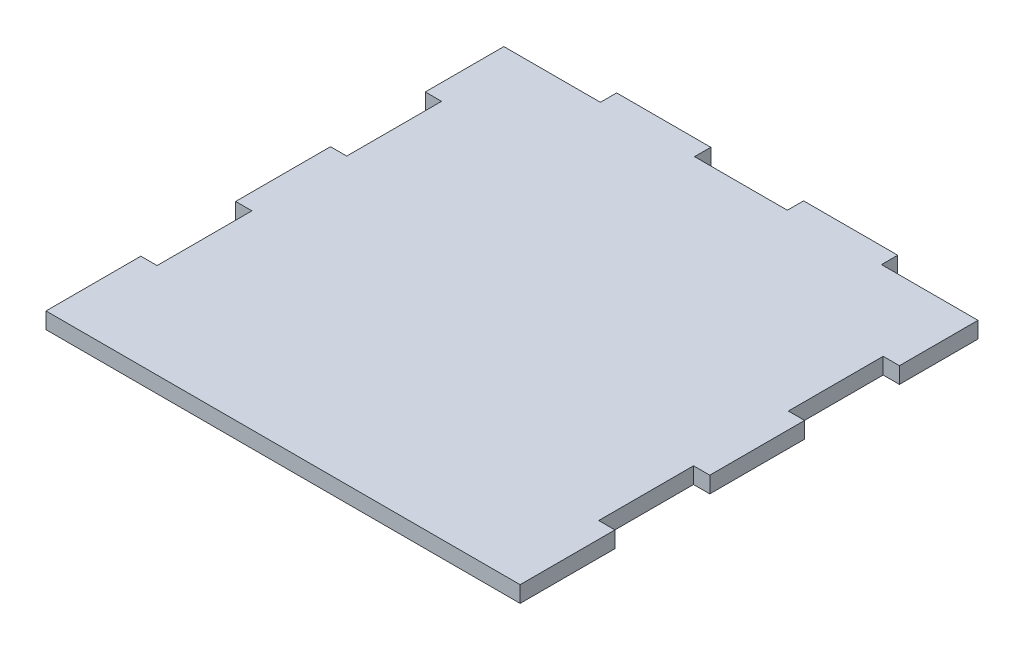
ISO-10303-21;
HEADER;
FILE_DESCRIPTION(('STEP AP214'),'2;1');
FILE_NAME('part.step','',(''),(''),'','','');
FILE_SCHEMA(('AUTOMOTIVE_DESIGN { 1 0 10303 214 1 1 1 1 }'));
ENDSEC;
DATA;
#1=APPLICATION_CONTEXT('core data for automotive mechanical design processes');
#2=APPLICATION_PROTOCOL_DEFINITION('international standard','automotive_design',2000,#1);
#3=PRODUCT_CONTEXT('',#1,'mechanical');
#4=PRODUCT('Part','Part','',(#3));
#5=PRODUCT_RELATED_PRODUCT_CATEGORY('part','',(#4));
#6=PRODUCT_DEFINITION_FORMATION('','',#4);
#7=PRODUCT_DEFINITION_CONTEXT('part definition',#1,'design');
#8=PRODUCT_DEFINITION('design','',#6,#7);
#9=PRODUCT_DEFINITION_SHAPE('','',#8);
#10=(LENGTH_UNIT() NAMED_UNIT(*) SI_UNIT(.MILLI.,.METRE.));
#11=(NAMED_UNIT(*) PLANE_ANGLE_UNIT() SI_UNIT($,.RADIAN.));
#12=(NAMED_UNIT(*) SI_UNIT($,.STERADIAN.) SOLID_ANGLE_UNIT());
#13=UNCERTAINTY_MEASURE_WITH_UNIT(LENGTH_MEASURE(1.E-05),#10,'distance_accuracy_value','');
#14=(GEOMETRIC_REPRESENTATION_CONTEXT(3) GLOBAL_UNCERTAINTY_ASSIGNED_CONTEXT((#13)) GLOBAL_UNIT_ASSIGNED_CONTEXT((#10,
#11,#12)) REPRESENTATION_CONTEXT('',''));
#15=CARTESIAN_POINT('',(0.,0.,0.));
#16=DIRECTION('',(0.,0.,1.));
#17=DIRECTION('',(1.,0.,0.));
#18=AXIS2_PLACEMENT_3D('',#15,#16,#17);
#19=CARTESIAN_POINT('',(0.,12.,-280.));
#20=DIRECTION('',(0.,0.,1.));
#21=DIRECTION('',(1.,0.,0.));
#22=AXIS2_PLACEMENT_3D('',#19,#20,#21);
#23=PLANE('',#22);
#24=DIRECTION('',(-1.,0.,0.));
#25=VECTOR('',#24,1.);
#26=CARTESIAN_POINT('',(0.,0.,-280.));
#27=LINE('',#26,#25);
#28=CARTESIAN_POINT('',(350.,0.,-280.));
#29=VERTEX_POINT('',#28);
#30=CARTESIAN_POINT('',(338.,0.,-280.));
#31=VERTEX_POINT('',#30);
#32=EDGE_CURVE('E260',#29,#31,#27,.T.);
#33=ORIENTED_EDGE('',*,*,#32,.F.);
#34=DIRECTION('',(0.,-1.,0.));
#35=VECTOR('',#34,1.);
#36=CARTESIAN_POINT('',(350.,12.,-280.));
#37=LINE('',#36,#35);
#38=CARTESIAN_POINT('',(350.,12.,-280.));
#39=VERTEX_POINT('',#38);
#40=EDGE_CURVE('E11',#39,#29,#37,.T.);
#41=ORIENTED_EDGE('',*,*,#40,.F.);
#42=DIRECTION('',(-1.,0.,0.));
#43=VECTOR('',#42,1.);
#44=CARTESIAN_POINT('',(0.,12.,-280.));
#45=LINE('',#44,#43);
#46=CARTESIAN_POINT('',(338.,12.,-280.));
#47=VERTEX_POINT('',#46);
#48=EDGE_CURVE('E363',#39,#47,#45,.T.);
#49=ORIENTED_EDGE('',*,*,#48,.T.);
#50=DIRECTION('',(0.,-1.,0.));
#51=VECTOR('',#50,1.);
#52=CARTESIAN_POINT('',(338.,12.,-280.));
#53=LINE('',#52,#51);
#54=EDGE_CURVE('E58',#47,#31,#53,.T.);
#55=ORIENTED_EDGE('',*,*,#54,.T.);
#56=EDGE_LOOP('',(#33,#41,#49,#55));
#57=FACE_BOUND('',#56,.T.);
#58=ADVANCED_FACE('F41',(#57),#23,.T.);
#59=CARTESIAN_POINT('',(350.,12.,0.));
#60=DIRECTION('',(-1.,0.,0.));
#61=DIRECTION('',(0.,0.,1.));
#62=AXIS2_PLACEMENT_3D('',#59,#60,#61);
#63=PLANE('',#62);
#64=DIRECTION('',(0.,0.,-1.));
#65=VECTOR('',#64,1.);
#66=CARTESIAN_POINT('',(350.,0.,0.));
#67=LINE('',#66,#65);
#68=CARTESIAN_POINT('',(350.,0.,-338.));
#69=VERTEX_POINT('',#68);
#70=EDGE_CURVE('E263',#29,#69,#67,.T.);
#71=ORIENTED_EDGE('',*,*,#70,.T.);
#72=DIRECTION('',(0.,-1.,0.));
#73=VECTOR('',#72,1.);
#74=CARTESIAN_POINT('',(350.,12.,-338.));
#75=LINE('',#74,#73);
#76=CARTESIAN_POINT('',(350.,12.,-338.));
#77=VERTEX_POINT('',#76);
#78=EDGE_CURVE('E50',#77,#69,#75,.T.);
#79=ORIENTED_EDGE('',*,*,#78,.F.);
#80=DIRECTION('',(0.,0.,-1.));
#81=VECTOR('',#80,1.);
#82=CARTESIAN_POINT('',(350.,12.,0.));
#83=LINE('',#82,#81);
#84=EDGE_CURVE('E469',#39,#77,#83,.T.);
#85=ORIENTED_EDGE('',*,*,#84,.F.);
#86=ORIENTED_EDGE('',*,*,#40,.T.);
#87=EDGE_LOOP('',(#71,#79,#85,#86));
#88=FACE_BOUND('',#87,.T.);
#89=ADVANCED_FACE('F554',(#88),#63,.F.);
#90=CARTESIAN_POINT('',(0.,12.,-338.));
#91=DIRECTION('',(0.,0.,1.));
#92=DIRECTION('',(1.,0.,0.));
#93=AXIS2_PLACEMENT_3D('',#90,#91,#92);
#94=PLANE('',#93);
#95=DIRECTION('',(-1.,0.,0.));
#96=VECTOR('',#95,1.);
#97=CARTESIAN_POINT('',(0.,0.,-338.));
#98=LINE('',#97,#96);
#99=CARTESIAN_POINT('',(278.75,0.,-338.));
#100=VERTEX_POINT('',#99);
#101=EDGE_CURVE('E266',#69,#100,#98,.T.);
#102=ORIENTED_EDGE('',*,*,#101,.T.);
#103=DIRECTION('',(0.,-1.,0.));
#104=VECTOR('',#103,1.);
#105=CARTESIAN_POINT('',(278.75,12.,-338.));
#106=LINE('',#105,#104);
#107=CARTESIAN_POINT('',(278.75,12.,-338.));
#108=VERTEX_POINT('',#107);
#109=EDGE_CURVE('E437',#108,#100,#106,.T.);
#110=ORIENTED_EDGE('',*,*,#109,.F.);
#111=DIRECTION('',(-1.,0.,0.));
#112=VECTOR('',#111,1.);
#113=CARTESIAN_POINT('',(0.,12.,-338.));
#114=LINE('',#113,#112);
#115=EDGE_CURVE('E447',#77,#108,#114,.T.);
#116=ORIENTED_EDGE('',*,*,#115,.F.);
#117=ORIENTED_EDGE('',*,*,#78,.T.);
#118=EDGE_LOOP('',(#102,#110,#116,#117));
#119=FACE_BOUND('',#118,.T.);
#120=ADVANCED_FACE('F445',(#119),#94,.F.);
#121=CARTESIAN_POINT('',(278.75,12.,0.));
#122=DIRECTION('',(1.,0.,0.));
#123=DIRECTION('',(0.,0.,-1.));
#124=AXIS2_PLACEMENT_3D('',#121,#122,#123);
#125=PLANE('',#124);
#126=DIRECTION('',(0.,0.,1.));
#127=VECTOR('',#126,1.);
#128=CARTESIAN_POINT('',(278.75,0.,0.));
#129=LINE('',#128,#127);
#130=CARTESIAN_POINT('',(278.75,0.,-350.));
#131=VERTEX_POINT('',#130);
#132=EDGE_CURVE('E270',#131,#100,#129,.T.);
#133=ORIENTED_EDGE('',*,*,#132,.F.);
#134=DIRECTION('',(0.,-1.,0.));
#135=VECTOR('',#134,1.);
#136=CARTESIAN_POINT('',(278.75,12.,-350.));
#137=LINE('',#136,#135);
#138=CARTESIAN_POINT('',(278.75,12.,-350.));
#139=VERTEX_POINT('',#138);
#140=EDGE_CURVE('E434',#139,#131,#137,.T.);
#141=ORIENTED_EDGE('',*,*,#140,.F.);
#142=DIRECTION('',(0.,0.,1.));
#143=VECTOR('',#142,1.);
#144=CARTESIAN_POINT('',(278.75,12.,0.));
#145=LINE('',#144,#143);
#146=EDGE_CURVE('E459',#139,#108,#145,.T.);
#147=ORIENTED_EDGE('',*,*,#146,.T.);
#148=ORIENTED_EDGE('',*,*,#109,.T.);
#149=EDGE_LOOP('',(#133,#141,#147,#148));
#150=FACE_BOUND('',#149,.T.);
#151=ADVANCED_FACE('F456',(#150),#125,.T.);
#152=CARTESIAN_POINT('',(-5.59105120314826E-13,12.,-350.));
#153=DIRECTION('',(0.,0.,-1.));
#154=DIRECTION('',(-1.,0.,0.));
#155=AXIS2_PLACEMENT_3D('',#152,#153,#154);
#156=PLANE('',#155);
#157=DIRECTION('',(1.,0.,0.));
#158=VECTOR('',#157,1.);
#159=CARTESIAN_POINT('',(-5.59105120314826E-13,0.,-350.));
#160=LINE('',#159,#158);
#161=CARTESIAN_POINT('',(209.25,0.,-350.));
#162=VERTEX_POINT('',#161);
#163=EDGE_CURVE('E274',#162,#131,#160,.T.);
#164=ORIENTED_EDGE('',*,*,#163,.F.);
#165=DIRECTION('',(0.,-1.,0.));
#166=VECTOR('',#165,1.);
#167=CARTESIAN_POINT('',(209.25,12.,-350.));
#168=LINE('',#167,#166);
#169=CARTESIAN_POINT('',(209.25,12.,-350.));
#170=VERTEX_POINT('',#169);
#171=EDGE_CURVE('E431',#170,#162,#168,.T.);
#172=ORIENTED_EDGE('',*,*,#171,.F.);
#173=DIRECTION('',(1.,0.,0.));
#174=VECTOR('',#173,1.);
#175=CARTESIAN_POINT('',(-5.59105120314826E-13,12.,-350.));
#176=LINE('',#175,#174);
#177=EDGE_CURVE('E463',#170,#139,#176,.T.);
#178=ORIENTED_EDGE('',*,*,#177,.T.);
#179=ORIENTED_EDGE('',*,*,#140,.T.);
#180=EDGE_LOOP('',(#164,#172,#178,#179));
#181=FACE_BOUND('',#180,.T.);
#182=ADVANCED_FACE('F565',(#181),#156,.T.);
#183=CARTESIAN_POINT('',(209.25,12.,0.));
#184=DIRECTION('',(1.,0.,0.));
#185=DIRECTION('',(0.,0.,-1.));
#186=AXIS2_PLACEMENT_3D('',#183,#184,#185);
#187=PLANE('',#186);
#188=DIRECTION('',(0.,0.,1.));
#189=VECTOR('',#188,1.);
#190=CARTESIAN_POINT('',(209.25,0.,0.));
#191=LINE('',#190,#189);
#192=CARTESIAN_POINT('',(209.25,0.,-338.));
#193=VERTEX_POINT('',#192);
#194=EDGE_CURVE('E278',#162,#193,#191,.T.);
#195=ORIENTED_EDGE('',*,*,#194,.T.);
#196=DIRECTION('',(0.,-1.,0.));
#197=VECTOR('',#196,1.);
#198=CARTESIAN_POINT('',(209.25,12.,-338.));
#199=LINE('',#198,#197);
#200=CARTESIAN_POINT('',(209.25,12.,-338.));
#201=VERTEX_POINT('',#200);
#202=EDGE_CURVE('E428',#201,#193,#199,.T.);
#203=ORIENTED_EDGE('',*,*,#202,.F.);
#204=DIRECTION('',(0.,0.,1.));
#205=VECTOR('',#204,1.);
#206=CARTESIAN_POINT('',(209.25,12.,0.));
#207=LINE('',#206,#205);
#208=EDGE_CURVE('E467',#170,#201,#207,.T.);
#209=ORIENTED_EDGE('',*,*,#208,.F.);
#210=ORIENTED_EDGE('',*,*,#171,.T.);
#211=EDGE_LOOP('',(#195,#203,#209,#210));
#212=FACE_BOUND('',#211,.T.);
#213=ADVANCED_FACE('F568',(#212),#187,.F.);
#214=CARTESIAN_POINT('',(-5.47818076384383E-13,12.,-338.));
#215=DIRECTION('',(0.,0.,-1.));
#216=DIRECTION('',(-1.,0.,0.));
#217=AXIS2_PLACEMENT_3D('',#214,#215,#216);
#218=PLANE('',#217);
#219=DIRECTION('',(1.,0.,0.));
#220=VECTOR('',#219,1.);
#221=CARTESIAN_POINT('',(-5.47818076384383E-13,0.,-338.));
#222=LINE('',#221,#220);
#223=CARTESIAN_POINT('',(140.75,0.,-338.));
#224=VERTEX_POINT('',#223);
#225=EDGE_CURVE('E282',#224,#193,#222,.T.);
#226=ORIENTED_EDGE('',*,*,#225,.F.);
#227=DIRECTION('',(0.,-1.,0.));
#228=VECTOR('',#227,1.);
#229=CARTESIAN_POINT('',(140.75,12.,-338.));
#230=LINE('',#229,#228);
#231=CARTESIAN_POINT('',(140.75,12.,-338.));
#232=VERTEX_POINT('',#231);
#233=EDGE_CURVE('E425',#232,#224,#230,.T.);
#234=ORIENTED_EDGE('',*,*,#233,.F.);
#235=DIRECTION('',(1.,0.,0.));
#236=VECTOR('',#235,1.);
#237=CARTESIAN_POINT('',(-5.47818076384383E-13,12.,-338.));
#238=LINE('',#237,#236);
#239=EDGE_CURVE('E475',#232,#201,#238,.T.);
#240=ORIENTED_EDGE('',*,*,#239,.T.);
#241=ORIENTED_EDGE('',*,*,#202,.T.);
#242=EDGE_LOOP('',(#226,#234,#240,#241));
#243=FACE_BOUND('',#242,.T.);
#244=ADVANCED_FACE('F572',(#243),#218,.T.);
#245=CARTESIAN_POINT('',(140.75,12.,0.));
#246=DIRECTION('',(1.,0.,0.));
#247=DIRECTION('',(0.,0.,-1.));
#248=AXIS2_PLACEMENT_3D('',#245,#246,#247);
#249=PLANE('',#248);
#250=DIRECTION('',(0.,0.,1.));
#251=VECTOR('',#250,1.);
#252=CARTESIAN_POINT('',(140.75,0.,0.));
#253=LINE('',#252,#251);
#254=CARTESIAN_POINT('',(140.75,0.,-350.));
#255=VERTEX_POINT('',#254);
#256=EDGE_CURVE('E286',#255,#224,#253,.T.);
#257=ORIENTED_EDGE('',*,*,#256,.F.);
#258=DIRECTION('',(0.,-1.,0.));
#259=VECTOR('',#258,1.);
#260=CARTESIAN_POINT('',(140.75,12.,-350.));
#261=LINE('',#260,#259);
#262=CARTESIAN_POINT('',(140.75,12.,-350.));
#263=VERTEX_POINT('',#262);
#264=EDGE_CURVE('E422',#263,#255,#261,.T.);
#265=ORIENTED_EDGE('',*,*,#264,.F.);
#266=DIRECTION('',(0.,0.,1.));
#267=VECTOR('',#266,1.);
#268=CARTESIAN_POINT('',(140.75,12.,0.));
#269=LINE('',#268,#267);
#270=EDGE_CURVE('E479',#263,#232,#269,.T.);
#271=ORIENTED_EDGE('',*,*,#270,.T.);
#272=ORIENTED_EDGE('',*,*,#233,.T.);
#273=EDGE_LOOP('',(#257,#265,#271,#272));
#274=FACE_BOUND('',#273,.T.);
#275=ADVANCED_FACE('F576',(#274),#249,.T.);
#276=CARTESIAN_POINT('',(0.,12.,-350.));
#277=DIRECTION('',(0.,0.,-1.));
#278=DIRECTION('',(-1.,0.,0.));
#279=AXIS2_PLACEMENT_3D('',#276,#277,#278);
#280=PLANE('',#279);
#281=DIRECTION('',(1.,0.,0.));
#282=VECTOR('',#281,1.);
#283=CARTESIAN_POINT('',(0.,0.,-350.));
#284=LINE('',#283,#282);
#285=CARTESIAN_POINT('',(71.25,0.,-350.));
#286=VERTEX_POINT('',#285);
#287=EDGE_CURVE('E290',#286,#255,#284,.T.);
#288=ORIENTED_EDGE('',*,*,#287,.F.);
#289=DIRECTION('',(0.,-1.,0.));
#290=VECTOR('',#289,1.);
#291=CARTESIAN_POINT('',(71.25,12.,-350.));
#292=LINE('',#291,#290);
#293=CARTESIAN_POINT('',(71.25,12.,-350.));
#294=VERTEX_POINT('',#293);
#295=EDGE_CURVE('E419',#294,#286,#292,.T.);
#296=ORIENTED_EDGE('',*,*,#295,.F.);
#297=DIRECTION('',(1.,0.,0.));
#298=VECTOR('',#297,1.);
#299=CARTESIAN_POINT('',(0.,12.,-350.));
#300=LINE('',#299,#298);
#301=EDGE_CURVE('E483',#294,#263,#300,.T.);
#302=ORIENTED_EDGE('',*,*,#301,.T.);
#303=ORIENTED_EDGE('',*,*,#264,.T.);
#304=EDGE_LOOP('',(#288,#296,#302,#303));
#305=FACE_BOUND('',#304,.T.);
#306=ADVANCED_FACE('F580',(#305),#280,.T.);
#307=CARTESIAN_POINT('',(71.2500000000004,12.,0.));
#308=DIRECTION('',(1.,0.,0.));
#309=DIRECTION('',(0.,0.,-1.));
#310=AXIS2_PLACEMENT_3D('',#307,#308,#309);
#311=PLANE('',#310);
#312=DIRECTION('',(0.,0.,1.));
#313=VECTOR('',#312,1.);
#314=CARTESIAN_POINT('',(71.2500000000004,0.,0.));
#315=LINE('',#314,#313);
#316=CARTESIAN_POINT('',(71.25,0.,-338.));
#317=VERTEX_POINT('',#316);
#318=EDGE_CURVE('E294',#286,#317,#315,.T.);
#319=ORIENTED_EDGE('',*,*,#318,.T.);
#320=DIRECTION('',(0.,-1.,0.));
#321=VECTOR('',#320,1.);
#322=CARTESIAN_POINT('',(71.25,12.,-338.));
#323=LINE('',#322,#321);
#324=CARTESIAN_POINT('',(71.25,12.,-338.));
#325=VERTEX_POINT('',#324);
#326=EDGE_CURVE('E416',#325,#317,#323,.T.);
#327=ORIENTED_EDGE('',*,*,#326,.F.);
#328=DIRECTION('',(0.,0.,1.));
#329=VECTOR('',#328,1.);
#330=CARTESIAN_POINT('',(71.2500000000004,12.,0.));
#331=LINE('',#330,#329);
#332=EDGE_CURVE('E487',#294,#325,#331,.T.);
#333=ORIENTED_EDGE('',*,*,#332,.F.);
#334=ORIENTED_EDGE('',*,*,#295,.T.);
#335=EDGE_LOOP('',(#319,#327,#333,#334));
#336=FACE_BOUND('',#335,.T.);
#337=ADVANCED_FACE('F584',(#336),#311,.F.);
#338=CARTESIAN_POINT('',(0.,12.,-338.));
#339=DIRECTION('',(0.,0.,-1.));
#340=DIRECTION('',(-1.,0.,0.));
#341=AXIS2_PLACEMENT_3D('',#338,#339,#340);
#342=PLANE('',#341);
#343=DIRECTION('',(1.,0.,0.));
#344=VECTOR('',#343,1.);
#345=CARTESIAN_POINT('',(0.,0.,-338.));
#346=LINE('',#345,#344);
#347=CARTESIAN_POINT('',(0.,0.,-338.));
#348=VERTEX_POINT('',#347);
#349=EDGE_CURVE('E298',#348,#317,#346,.T.);
#350=ORIENTED_EDGE('',*,*,#349,.F.);
#351=DIRECTION('',(0.,-1.,0.));
#352=VECTOR('',#351,1.);
#353=CARTESIAN_POINT('',(0.,12.,-338.));
#354=LINE('',#353,#352);
#355=CARTESIAN_POINT('',(0.,12.,-338.));
#356=VERTEX_POINT('',#355);
#357=EDGE_CURVE('E413',#356,#348,#354,.T.);
#358=ORIENTED_EDGE('',*,*,#357,.F.);
#359=DIRECTION('',(1.,0.,0.));
#360=VECTOR('',#359,1.);
#361=CARTESIAN_POINT('',(0.,12.,-338.));
#362=LINE('',#361,#360);
#363=EDGE_CURVE('E490',#356,#325,#362,.T.);
#364=ORIENTED_EDGE('',*,*,#363,.T.);
#365=ORIENTED_EDGE('',*,*,#326,.T.);
#366=EDGE_LOOP('',(#350,#358,#364,#365));
#367=FACE_BOUND('',#366,.T.);
#368=ADVANCED_FACE('F588',(#367),#342,.T.);
#369=CARTESIAN_POINT('',(0.,12.,0.));
#370=DIRECTION('',(-1.,0.,0.));
#371=DIRECTION('',(0.,0.,1.));
#372=AXIS2_PLACEMENT_3D('',#369,#370,#371);
#373=PLANE('',#372);
#374=DIRECTION('',(0.,0.,-1.));
#375=VECTOR('',#374,1.);
#376=CARTESIAN_POINT('',(0.,0.,0.));
#377=LINE('',#376,#375);
#378=CARTESIAN_POINT('',(0.,0.,-280.));
#379=VERTEX_POINT('',#378);
#380=EDGE_CURVE('E302',#379,#348,#377,.T.);
#381=ORIENTED_EDGE('',*,*,#380,.F.);
#382=DIRECTION('',(0.,-1.,0.));
#383=VECTOR('',#382,1.);
#384=CARTESIAN_POINT('',(0.,12.,-280.));
#385=LINE('',#384,#383);
#386=CARTESIAN_POINT('',(0.,12.,-280.));
#387=VERTEX_POINT('',#386);
#388=EDGE_CURVE('E410',#387,#379,#385,.T.);
#389=ORIENTED_EDGE('',*,*,#388,.F.);
#390=DIRECTION('',(0.,0.,-1.));
#391=VECTOR('',#390,1.);
#392=CARTESIAN_POINT('',(0.,12.,0.));
#393=LINE('',#392,#391);
#394=EDGE_CURVE('E494',#387,#356,#393,.T.);
#395=ORIENTED_EDGE('',*,*,#394,.T.);
#396=ORIENTED_EDGE('',*,*,#357,.T.);
#397=EDGE_LOOP('',(#381,#389,#395,#396));
#398=FACE_BOUND('',#397,.T.);
#399=ADVANCED_FACE('F592',(#398),#373,.T.);
#400=CARTESIAN_POINT('',(0.,12.,-280.));
#401=DIRECTION('',(0.,0.,-1.));
#402=DIRECTION('',(-1.,0.,0.));
#403=AXIS2_PLACEMENT_3D('',#400,#401,#402);
#404=PLANE('',#403);
#405=DIRECTION('',(1.,0.,0.));
#406=VECTOR('',#405,1.);
#407=CARTESIAN_POINT('',(0.,0.,-280.));
#408=LINE('',#407,#406);
#409=CARTESIAN_POINT('',(12.,0.,-280.));
#410=VERTEX_POINT('',#409);
#411=EDGE_CURVE('E306',#379,#410,#408,.T.);
#412=ORIENTED_EDGE('',*,*,#411,.T.);
#413=DIRECTION('',(0.,-1.,0.));
#414=VECTOR('',#413,1.);
#415=CARTESIAN_POINT('',(12.,12.,-280.));
#416=LINE('',#415,#414);
#417=CARTESIAN_POINT('',(12.,12.,-280.));
#418=VERTEX_POINT('',#417);
#419=EDGE_CURVE('E406',#418,#410,#416,.T.);
#420=ORIENTED_EDGE('',*,*,#419,.F.);
#421=DIRECTION('',(1.,0.,0.));
#422=VECTOR('',#421,1.);
#423=CARTESIAN_POINT('',(0.,12.,-280.));
#424=LINE('',#423,#422);
#425=EDGE_CURVE('E498',#387,#418,#424,.T.);
#426=ORIENTED_EDGE('',*,*,#425,.F.);
#427=ORIENTED_EDGE('',*,*,#388,.T.);
#428=EDGE_LOOP('',(#412,#420,#426,#427));
#429=FACE_BOUND('',#428,.T.);
#430=ADVANCED_FACE('F596',(#429),#404,.F.);
#431=CARTESIAN_POINT('',(12.,12.,0.));
#432=DIRECTION('',(1.,0.,0.));
#433=DIRECTION('',(0.,0.,-1.));
#434=AXIS2_PLACEMENT_3D('',#431,#432,#433);
#435=PLANE('',#434);
#436=DIRECTION('',(0.,0.,1.));
#437=VECTOR('',#436,1.);
#438=CARTESIAN_POINT('',(12.,0.,0.));
#439=LINE('',#438,#437);
#440=CARTESIAN_POINT('',(12.,0.,-210.));
#441=VERTEX_POINT('',#440);
#442=EDGE_CURVE('E309',#410,#441,#439,.T.);
#443=ORIENTED_EDGE('',*,*,#442,.T.);
#444=DIRECTION('',(0.,-1.,0.));
#445=VECTOR('',#444,1.);
#446=CARTESIAN_POINT('',(12.,12.,-210.));
#447=LINE('',#446,#445);
#448=CARTESIAN_POINT('',(12.,12.,-210.));
#449=VERTEX_POINT('',#448);
#450=EDGE_CURVE('E403',#449,#441,#447,.T.);
#451=ORIENTED_EDGE('',*,*,#450,.F.);
#452=DIRECTION('',(0.,0.,1.));
#453=VECTOR('',#452,1.);
#454=CARTESIAN_POINT('',(12.,12.,0.));
#455=LINE('',#454,#453);
#456=EDGE_CURVE('E501',#418,#449,#455,.T.);
#457=ORIENTED_EDGE('',*,*,#456,.F.);
#458=ORIENTED_EDGE('',*,*,#419,.T.);
#459=EDGE_LOOP('',(#443,#451,#457,#458));
#460=FACE_BOUND('',#459,.T.);
#461=ADVANCED_FACE('F600',(#460),#435,.F.);
#462=CARTESIAN_POINT('',(0.,12.,-210.));
#463=DIRECTION('',(0.,0.,-1.));
#464=DIRECTION('',(-1.,0.,0.));
#465=AXIS2_PLACEMENT_3D('',#462,#463,#464);
#466=PLANE('',#465);
#467=DIRECTION('',(1.,0.,0.));
#468=VECTOR('',#467,1.);
#469=CARTESIAN_POINT('',(0.,0.,-210.));
#470=LINE('',#469,#468);
#471=CARTESIAN_POINT('',(0.,0.,-210.));
#472=VERTEX_POINT('',#471);
#473=EDGE_CURVE('E313',#472,#441,#470,.T.);
#474=ORIENTED_EDGE('',*,*,#473,.F.);
#475=DIRECTION('',(0.,-1.,0.));
#476=VECTOR('',#475,1.);
#477=CARTESIAN_POINT('',(0.,12.,-210.));
#478=LINE('',#477,#476);
#479=CARTESIAN_POINT('',(0.,12.,-210.));
#480=VERTEX_POINT('',#479);
#481=EDGE_CURVE('E400',#480,#472,#478,.T.);
#482=ORIENTED_EDGE('',*,*,#481,.F.);
#483=DIRECTION('',(1.,0.,0.));
#484=VECTOR('',#483,1.);
#485=CARTESIAN_POINT('',(0.,12.,-210.));
#486=LINE('',#485,#484);
#487=EDGE_CURVE('E504',#480,#449,#486,.T.);
#488=ORIENTED_EDGE('',*,*,#487,.T.);
#489=ORIENTED_EDGE('',*,*,#450,.T.);
#490=EDGE_LOOP('',(#474,#482,#488,#489));
#491=FACE_BOUND('',#490,.T.);
#492=ADVANCED_FACE('F604',(#491),#466,.T.);
#493=CARTESIAN_POINT('',(0.,12.,0.));
#494=DIRECTION('',(-1.,0.,0.));
#495=DIRECTION('',(0.,0.,1.));
#496=AXIS2_PLACEMENT_3D('',#493,#494,#495);
#497=PLANE('',#496);
#498=DIRECTION('',(0.,0.,-1.));
#499=VECTOR('',#498,1.);
#500=CARTESIAN_POINT('',(0.,0.,0.));
#501=LINE('',#500,#499);
#502=CARTESIAN_POINT('',(0.,0.,-140.));
#503=VERTEX_POINT('',#502);
#504=EDGE_CURVE('E317',#503,#472,#501,.T.);
#505=ORIENTED_EDGE('',*,*,#504,.F.);
#506=DIRECTION('',(0.,-1.,0.));
#507=VECTOR('',#506,1.);
#508=CARTESIAN_POINT('',(0.,12.,-140.));
#509=LINE('',#508,#507);
#510=CARTESIAN_POINT('',(0.,12.,-140.));
#511=VERTEX_POINT('',#510);
#512=EDGE_CURVE('E397',#511,#503,#509,.T.);
#513=ORIENTED_EDGE('',*,*,#512,.F.);
#514=DIRECTION('',(0.,0.,-1.));
#515=VECTOR('',#514,1.);
#516=CARTESIAN_POINT('',(0.,12.,0.));
#517=LINE('',#516,#515);
#518=EDGE_CURVE('E508',#511,#480,#517,.T.);
#519=ORIENTED_EDGE('',*,*,#518,.T.);
#520=ORIENTED_EDGE('',*,*,#481,.T.);
#521=EDGE_LOOP('',(#505,#513,#519,#520));
#522=FACE_BOUND('',#521,.T.);
#523=ADVANCED_FACE('F608',(#522),#497,.T.);
#524=CARTESIAN_POINT('',(0.,12.,-140.));
#525=DIRECTION('',(0.,0.,-1.));
#526=DIRECTION('',(-1.,0.,0.));
#527=AXIS2_PLACEMENT_3D('',#524,#525,#526);
#528=PLANE('',#527);
#529=DIRECTION('',(1.,0.,0.));
#530=VECTOR('',#529,1.);
#531=CARTESIAN_POINT('',(0.,0.,-140.));
#532=LINE('',#531,#530);
#533=CARTESIAN_POINT('',(12.,0.,-140.));
#534=VERTEX_POINT('',#533);
#535=EDGE_CURVE('E321',#503,#534,#532,.T.);
#536=ORIENTED_EDGE('',*,*,#535,.T.);
#537=DIRECTION('',(0.,-1.,0.));
#538=VECTOR('',#537,1.);
#539=CARTESIAN_POINT('',(12.,12.,-140.));
#540=LINE('',#539,#538);
#541=CARTESIAN_POINT('',(12.,12.,-140.));
#542=VERTEX_POINT('',#541);
#543=EDGE_CURVE('E393',#542,#534,#540,.T.);
#544=ORIENTED_EDGE('',*,*,#543,.F.);
#545=DIRECTION('',(1.,0.,0.));
#546=VECTOR('',#545,1.);
#547=CARTESIAN_POINT('',(0.,12.,-140.));
#548=LINE('',#547,#546);
#549=EDGE_CURVE('E512',#511,#542,#548,.T.);
#550=ORIENTED_EDGE('',*,*,#549,.F.);
#551=ORIENTED_EDGE('',*,*,#512,.T.);
#552=EDGE_LOOP('',(#536,#544,#550,#551));
#553=FACE_BOUND('',#552,.T.);
#554=ADVANCED_FACE('F612',(#553),#528,.F.);
#555=CARTESIAN_POINT('',(12.,12.,0.));
#556=DIRECTION('',(1.,0.,0.));
#557=DIRECTION('',(0.,0.,-1.));
#558=AXIS2_PLACEMENT_3D('',#555,#556,#557);
#559=PLANE('',#558);
#560=DIRECTION('',(0.,0.,1.));
#561=VECTOR('',#560,1.);
#562=CARTESIAN_POINT('',(12.,0.,0.));
#563=LINE('',#562,#561);
#564=CARTESIAN_POINT('',(12.,0.,-70.));
#565=VERTEX_POINT('',#564);
#566=EDGE_CURVE('E324',#534,#565,#563,.T.);
#567=ORIENTED_EDGE('',*,*,#566,.T.);
#568=DIRECTION('',(0.,-1.,0.));
#569=VECTOR('',#568,1.);
#570=CARTESIAN_POINT('',(12.,12.,-70.));
#571=LINE('',#570,#569);
#572=CARTESIAN_POINT('',(12.,12.,-70.));
#573=VERTEX_POINT('',#572);
#574=EDGE_CURVE('E390',#573,#565,#571,.T.);
#575=ORIENTED_EDGE('',*,*,#574,.F.);
#576=DIRECTION('',(0.,0.,1.));
#577=VECTOR('',#576,1.);
#578=CARTESIAN_POINT('',(12.,12.,0.));
#579=LINE('',#578,#577);
#580=EDGE_CURVE('E515',#542,#573,#579,.T.);
#581=ORIENTED_EDGE('',*,*,#580,.F.);
#582=ORIENTED_EDGE('',*,*,#543,.T.);
#583=EDGE_LOOP('',(#567,#575,#581,#582));
#584=FACE_BOUND('',#583,.T.);
#585=ADVANCED_FACE('F616',(#584),#559,.F.);
#586=CARTESIAN_POINT('',(0.,12.,-70.));
#587=DIRECTION('',(0.,0.,-1.));
#588=DIRECTION('',(-1.,0.,0.));
#589=AXIS2_PLACEMENT_3D('',#586,#587,#588);
#590=PLANE('',#589);
#591=DIRECTION('',(1.,0.,0.));
#592=VECTOR('',#591,1.);
#593=CARTESIAN_POINT('',(0.,0.,-70.));
#594=LINE('',#593,#592);
#595=CARTESIAN_POINT('',(0.,0.,-70.));
#596=VERTEX_POINT('',#595);
#597=EDGE_CURVE('E328',#596,#565,#594,.T.);
#598=ORIENTED_EDGE('',*,*,#597,.F.);
#599=DIRECTION('',(0.,-1.,0.));
#600=VECTOR('',#599,1.);
#601=CARTESIAN_POINT('',(0.,12.,-70.));
#602=LINE('',#601,#600);
#603=CARTESIAN_POINT('',(0.,12.,-70.));
#604=VERTEX_POINT('',#603);
#605=EDGE_CURVE('E387',#604,#596,#602,.T.);
#606=ORIENTED_EDGE('',*,*,#605,.F.);
#607=DIRECTION('',(1.,0.,0.));
#608=VECTOR('',#607,1.);
#609=CARTESIAN_POINT('',(0.,12.,-70.));
#610=LINE('',#609,#608);
#611=EDGE_CURVE('E518',#604,#573,#610,.T.);
#612=ORIENTED_EDGE('',*,*,#611,.T.);
#613=ORIENTED_EDGE('',*,*,#574,.T.);
#614=EDGE_LOOP('',(#598,#606,#612,#613));
#615=FACE_BOUND('',#614,.T.);
#616=ADVANCED_FACE('F620',(#615),#590,.T.);
#617=CARTESIAN_POINT('',(0.,12.,0.));
#618=DIRECTION('',(-1.,0.,0.));
#619=DIRECTION('',(0.,0.,1.));
#620=AXIS2_PLACEMENT_3D('',#617,#618,#619);
#621=PLANE('',#620);
#622=DIRECTION('',(0.,0.,-1.));
#623=VECTOR('',#622,1.);
#624=CARTESIAN_POINT('',(0.,0.,0.));
#625=LINE('',#624,#623);
#626=CARTESIAN_POINT('',(0.,0.,0.));
#627=VERTEX_POINT('',#626);
#628=EDGE_CURVE('E332',#627,#596,#625,.T.);
#629=ORIENTED_EDGE('',*,*,#628,.F.);
#630=DIRECTION('',(0.,-1.,0.));
#631=VECTOR('',#630,1.);
#632=CARTESIAN_POINT('',(0.,12.,0.));
#633=LINE('',#632,#631);
#634=CARTESIAN_POINT('',(0.,12.,0.));
#635=VERTEX_POINT('',#634);
#636=EDGE_CURVE('E384',#635,#627,#633,.T.);
#637=ORIENTED_EDGE('',*,*,#636,.F.);
#638=DIRECTION('',(0.,0.,-1.));
#639=VECTOR('',#638,1.);
#640=CARTESIAN_POINT('',(0.,12.,0.));
#641=LINE('',#640,#639);
#642=EDGE_CURVE('E522',#635,#604,#641,.T.);
#643=ORIENTED_EDGE('',*,*,#642,.T.);
#644=ORIENTED_EDGE('',*,*,#605,.T.);
#645=EDGE_LOOP('',(#629,#637,#643,#644));
#646=FACE_BOUND('',#645,.T.);
#647=ADVANCED_FACE('F624',(#646),#621,.T.);
#648=CARTESIAN_POINT('',(0.,12.,0.));
#649=DIRECTION('',(0.,0.,-1.));
#650=DIRECTION('',(-1.,0.,0.));
#651=AXIS2_PLACEMENT_3D('',#648,#649,#650);
#652=PLANE('',#651);
#653=DIRECTION('',(1.,0.,0.));
#654=VECTOR('',#653,1.);
#655=CARTESIAN_POINT('',(0.,0.,0.));
#656=LINE('',#655,#654);
#657=CARTESIAN_POINT('',(350.,0.,0.));
#658=VERTEX_POINT('',#657);
#659=EDGE_CURVE('E336',#627,#658,#656,.T.);
#660=ORIENTED_EDGE('',*,*,#659,.T.);
#661=DIRECTION('',(0.,-1.,0.));
#662=VECTOR('',#661,1.);
#663=CARTESIAN_POINT('',(350.,12.,0.));
#664=LINE('',#663,#662);
#665=CARTESIAN_POINT('',(350.,12.,0.));
#666=VERTEX_POINT('',#665);
#667=EDGE_CURVE('E380',#666,#658,#664,.T.);
#668=ORIENTED_EDGE('',*,*,#667,.F.);
#669=DIRECTION('',(1.,0.,0.));
#670=VECTOR('',#669,1.);
#671=CARTESIAN_POINT('',(0.,12.,0.));
#672=LINE('',#671,#670);
#673=EDGE_CURVE('E526',#635,#666,#672,.T.);
#674=ORIENTED_EDGE('',*,*,#673,.F.);
#675=ORIENTED_EDGE('',*,*,#636,.T.);
#676=EDGE_LOOP('',(#660,#668,#674,#675));
#677=FACE_BOUND('',#676,.T.);
#678=ADVANCED_FACE('F628',(#677),#652,.F.);
#679=CARTESIAN_POINT('',(350.,12.,0.));
#680=DIRECTION('',(-1.,0.,0.));
#681=DIRECTION('',(0.,0.,1.));
#682=AXIS2_PLACEMENT_3D('',#679,#680,#681);
#683=PLANE('',#682);
#684=DIRECTION('',(0.,0.,-1.));
#685=VECTOR('',#684,1.);
#686=CARTESIAN_POINT('',(350.,0.,0.));
#687=LINE('',#686,#685);
#688=CARTESIAN_POINT('',(350.,0.,-70.));
#689=VERTEX_POINT('',#688);
#690=EDGE_CURVE('E339',#658,#689,#687,.T.);
#691=ORIENTED_EDGE('',*,*,#690,.T.);
#692=DIRECTION('',(0.,-1.,0.));
#693=VECTOR('',#692,1.);
#694=CARTESIAN_POINT('',(350.,12.,-70.));
#695=LINE('',#694,#693);
#696=CARTESIAN_POINT('',(350.,12.,-70.));
#697=VERTEX_POINT('',#696);
#698=EDGE_CURVE('E376',#697,#689,#695,.T.);
#699=ORIENTED_EDGE('',*,*,#698,.F.);
#700=DIRECTION('',(0.,0.,-1.));
#701=VECTOR('',#700,1.);
#702=CARTESIAN_POINT('',(350.,12.,0.));
#703=LINE('',#702,#701);
#704=EDGE_CURVE('E529',#666,#697,#703,.T.);
#705=ORIENTED_EDGE('',*,*,#704,.F.);
#706=ORIENTED_EDGE('',*,*,#667,.T.);
#707=EDGE_LOOP('',(#691,#699,#705,#706));
#708=FACE_BOUND('',#707,.T.);
#709=ADVANCED_FACE('F632',(#708),#683,.F.);
#710=CARTESIAN_POINT('',(0.,12.,-70.));
#711=DIRECTION('',(0.,0.,1.));
#712=DIRECTION('',(1.,0.,0.));
#713=AXIS2_PLACEMENT_3D('',#710,#711,#712);
#714=PLANE('',#713);
#715=DIRECTION('',(-1.,0.,0.));
#716=VECTOR('',#715,1.);
#717=CARTESIAN_POINT('',(0.,0.,-70.));
#718=LINE('',#717,#716);
#719=CARTESIAN_POINT('',(338.,0.,-70.));
#720=VERTEX_POINT('',#719);
#721=EDGE_CURVE('E342',#689,#720,#718,.T.);
#722=ORIENTED_EDGE('',*,*,#721,.T.);
#723=DIRECTION('',(0.,-1.,0.));
#724=VECTOR('',#723,1.);
#725=CARTESIAN_POINT('',(338.,12.,-70.));
#726=LINE('',#725,#724);
#727=CARTESIAN_POINT('',(338.,12.,-70.));
#728=VERTEX_POINT('',#727);
#729=EDGE_CURVE('E373',#728,#720,#726,.T.);
#730=ORIENTED_EDGE('',*,*,#729,.F.);
#731=DIRECTION('',(-1.,0.,0.));
#732=VECTOR('',#731,1.);
#733=CARTESIAN_POINT('',(0.,12.,-70.));
#734=LINE('',#733,#732);
#735=EDGE_CURVE('E532',#697,#728,#734,.T.);
#736=ORIENTED_EDGE('',*,*,#735,.F.);
#737=ORIENTED_EDGE('',*,*,#698,.T.);
#738=EDGE_LOOP('',(#722,#730,#736,#737));
#739=FACE_BOUND('',#738,.T.);
#740=ADVANCED_FACE('F636',(#739),#714,.F.);
#741=CARTESIAN_POINT('',(338.,12.,0.));
#742=DIRECTION('',(1.,0.,0.));
#743=DIRECTION('',(0.,0.,-1.));
#744=AXIS2_PLACEMENT_3D('',#741,#742,#743);
#745=PLANE('',#744);
#746=DIRECTION('',(0.,0.,1.));
#747=VECTOR('',#746,1.);
#748=CARTESIAN_POINT('',(338.,0.,0.));
#749=LINE('',#748,#747);
#750=CARTESIAN_POINT('',(338.,0.,-140.));
#751=VERTEX_POINT('',#750);
#752=EDGE_CURVE('E346',#751,#720,#749,.T.);
#753=ORIENTED_EDGE('',*,*,#752,.F.);
#754=DIRECTION('',(0.,-1.,0.));
#755=VECTOR('',#754,1.);
#756=CARTESIAN_POINT('',(338.,12.,-140.));
#757=LINE('',#756,#755);
#758=CARTESIAN_POINT('',(338.,12.,-140.));
#759=VERTEX_POINT('',#758);
#760=EDGE_CURVE('E370',#759,#751,#757,.T.);
#761=ORIENTED_EDGE('',*,*,#760,.F.);
#762=DIRECTION('',(0.,0.,1.));
#763=VECTOR('',#762,1.);
#764=CARTESIAN_POINT('',(338.,12.,0.));
#765=LINE('',#764,#763);
#766=EDGE_CURVE('E535',#759,#728,#765,.T.);
#767=ORIENTED_EDGE('',*,*,#766,.T.);
#768=ORIENTED_EDGE('',*,*,#729,.T.);
#769=EDGE_LOOP('',(#753,#761,#767,#768));
#770=FACE_BOUND('',#769,.T.);
#771=ADVANCED_FACE('F640',(#770),#745,.T.);
#772=CARTESIAN_POINT('',(0.,12.,-140.));
#773=DIRECTION('',(0.,0.,1.));
#774=DIRECTION('',(1.,0.,0.));
#775=AXIS2_PLACEMENT_3D('',#772,#773,#774);
#776=PLANE('',#775);
#777=DIRECTION('',(-1.,0.,0.));
#778=VECTOR('',#777,1.);
#779=CARTESIAN_POINT('',(0.,0.,-140.));
#780=LINE('',#779,#778);
#781=CARTESIAN_POINT('',(350.,0.,-140.));
#782=VERTEX_POINT('',#781);
#783=EDGE_CURVE('E350',#782,#751,#780,.T.);
#784=ORIENTED_EDGE('',*,*,#783,.F.);
#785=DIRECTION('',(0.,-1.,0.));
#786=VECTOR('',#785,1.);
#787=CARTESIAN_POINT('',(350.,12.,-140.));
#788=LINE('',#787,#786);
#789=CARTESIAN_POINT('',(350.,12.,-140.));
#790=VERTEX_POINT('',#789);
#791=EDGE_CURVE('E250',#790,#782,#788,.T.);
#792=ORIENTED_EDGE('',*,*,#791,.F.);
#793=DIRECTION('',(-1.,0.,0.));
#794=VECTOR('',#793,1.);
#795=CARTESIAN_POINT('',(0.,12.,-140.));
#796=LINE('',#795,#794);
#797=EDGE_CURVE('E238',#790,#759,#796,.T.);
#798=ORIENTED_EDGE('',*,*,#797,.T.);
#799=ORIENTED_EDGE('',*,*,#760,.T.);
#800=EDGE_LOOP('',(#784,#792,#798,#799));
#801=FACE_BOUND('',#800,.T.);
#802=ADVANCED_FACE('F541',(#801),#776,.T.);
#803=CARTESIAN_POINT('',(350.,12.,2.77555756156289E-13));
#804=DIRECTION('',(-1.,0.,0.));
#805=DIRECTION('',(0.,0.,1.));
#806=AXIS2_PLACEMENT_3D('',#803,#804,#805);
#807=PLANE('',#806);
#808=DIRECTION('',(0.,0.,-1.));
#809=VECTOR('',#808,1.);
#810=CARTESIAN_POINT('',(350.,0.,2.77555756156289E-13));
#811=LINE('',#810,#809);
#812=CARTESIAN_POINT('',(350.,0.,-210.));
#813=VERTEX_POINT('',#812);
#814=EDGE_CURVE('E246',#782,#813,#811,.T.);
#815=ORIENTED_EDGE('',*,*,#814,.T.);
#816=DIRECTION('',(0.,-1.,0.));
#817=VECTOR('',#816,1.);
#818=CARTESIAN_POINT('',(350.,12.,-210.));
#819=LINE('',#818,#817);
#820=CARTESIAN_POINT('',(350.,12.,-210.));
#821=VERTEX_POINT('',#820);
#822=EDGE_CURVE('E243',#821,#813,#819,.T.);
#823=ORIENTED_EDGE('',*,*,#822,.F.);
#824=DIRECTION('',(0.,0.,-1.));
#825=VECTOR('',#824,1.);
#826=CARTESIAN_POINT('',(350.,12.,2.77555756156289E-13));
#827=LINE('',#826,#825);
#828=EDGE_CURVE('E229',#790,#821,#827,.T.);
#829=ORIENTED_EDGE('',*,*,#828,.F.);
#830=ORIENTED_EDGE('',*,*,#791,.T.);
#831=EDGE_LOOP('',(#815,#823,#829,#830));
#832=FACE_BOUND('',#831,.T.);
#833=ADVANCED_FACE('F244',(#832),#807,.F.);
#834=CARTESIAN_POINT('',(0.,12.,-210.));
#835=DIRECTION('',(0.,0.,1.));
#836=DIRECTION('',(1.,0.,0.));
#837=AXIS2_PLACEMENT_3D('',#834,#835,#836);
#838=PLANE('',#837);
#839=DIRECTION('',(-1.,0.,0.));
#840=VECTOR('',#839,1.);
#841=CARTESIAN_POINT('',(0.,0.,-210.));
#842=LINE('',#841,#840);
#843=CARTESIAN_POINT('',(338.,0.,-210.));
#844=VERTEX_POINT('',#843);
#845=EDGE_CURVE('E356',#813,#844,#842,.T.);
#846=ORIENTED_EDGE('',*,*,#845,.T.);
#847=DIRECTION('',(0.,-1.,0.));
#848=VECTOR('',#847,1.);
#849=CARTESIAN_POINT('',(338.,12.,-210.));
#850=LINE('',#849,#848);
#851=CARTESIAN_POINT('',(338.,12.,-210.));
#852=VERTEX_POINT('',#851);
#853=EDGE_CURVE('E144',#852,#844,#850,.T.);
#854=ORIENTED_EDGE('',*,*,#853,.F.);
#855=DIRECTION('',(-1.,0.,0.));
#856=VECTOR('',#855,1.);
#857=CARTESIAN_POINT('',(0.,12.,-210.));
#858=LINE('',#857,#856);
#859=EDGE_CURVE('E235',#821,#852,#858,.T.);
#860=ORIENTED_EDGE('',*,*,#859,.F.);
#861=ORIENTED_EDGE('',*,*,#822,.T.);
#862=EDGE_LOOP('',(#846,#854,#860,#861));
#863=FACE_BOUND('',#862,.T.);
#864=ADVANCED_FACE('F252',(#863),#838,.F.);
#865=CARTESIAN_POINT('',(338.,12.,0.));
#866=DIRECTION('',(1.,0.,0.));
#867=DIRECTION('',(0.,0.,-1.));
#868=AXIS2_PLACEMENT_3D('',#865,#866,#867);
#869=PLANE('',#868);
#870=DIRECTION('',(0.,0.,1.));
#871=VECTOR('',#870,1.);
#872=CARTESIAN_POINT('',(338.,0.,0.));
#873=LINE('',#872,#871);
#874=EDGE_CURVE('E359',#31,#844,#873,.T.);
#875=ORIENTED_EDGE('',*,*,#874,.F.);
#876=ORIENTED_EDGE('',*,*,#54,.F.);
#877=DIRECTION('',(0.,0.,1.));
#878=VECTOR('',#877,1.);
#879=CARTESIAN_POINT('',(338.,12.,0.));
#880=LINE('',#879,#878);
#881=EDGE_CURVE('E254',#47,#852,#880,.T.);
#882=ORIENTED_EDGE('',*,*,#881,.T.);
#883=ORIENTED_EDGE('',*,*,#853,.T.);
#884=EDGE_LOOP('',(#875,#876,#882,#883));
#885=FACE_BOUND('',#884,.T.);
#886=ADVANCED_FACE('F543',(#885),#869,.T.);
#887=CARTESIAN_POINT('',(0.,12.,0.));
#888=DIRECTION('',(0.,1.,0.));
#889=DIRECTION('',(0.,0.,1.));
#890=AXIS2_PLACEMENT_3D('',#887,#888,#889);
#891=PLANE('',#890);
#892=ORIENTED_EDGE('',*,*,#48,.F.);
#893=ORIENTED_EDGE('',*,*,#84,.T.);
#894=ORIENTED_EDGE('',*,*,#115,.T.);
#895=ORIENTED_EDGE('',*,*,#146,.F.);
#896=ORIENTED_EDGE('',*,*,#177,.F.);
#897=ORIENTED_EDGE('',*,*,#208,.T.);
#898=ORIENTED_EDGE('',*,*,#239,.F.);
#899=ORIENTED_EDGE('',*,*,#270,.F.);
#900=ORIENTED_EDGE('',*,*,#301,.F.);
#901=ORIENTED_EDGE('',*,*,#332,.T.);
#902=ORIENTED_EDGE('',*,*,#363,.F.);
#903=ORIENTED_EDGE('',*,*,#394,.F.);
#904=ORIENTED_EDGE('',*,*,#425,.T.);
#905=ORIENTED_EDGE('',*,*,#456,.T.);
#906=ORIENTED_EDGE('',*,*,#487,.F.);
#907=ORIENTED_EDGE('',*,*,#518,.F.);
#908=ORIENTED_EDGE('',*,*,#549,.T.);
#909=ORIENTED_EDGE('',*,*,#580,.T.);
#910=ORIENTED_EDGE('',*,*,#611,.F.);
#911=ORIENTED_EDGE('',*,*,#642,.F.);
#912=ORIENTED_EDGE('',*,*,#673,.T.);
#913=ORIENTED_EDGE('',*,*,#704,.T.);
#914=ORIENTED_EDGE('',*,*,#735,.T.);
#915=ORIENTED_EDGE('',*,*,#766,.F.);
#916=ORIENTED_EDGE('',*,*,#797,.F.);
#917=ORIENTED_EDGE('',*,*,#828,.T.);
#918=ORIENTED_EDGE('',*,*,#859,.T.);
#919=ORIENTED_EDGE('',*,*,#881,.F.);
#920=EDGE_LOOP('',(#892,#893,#894,#895,#896,#897,#898,#899,#900,#901,#902,#903,#904,#905,#906,
#907,#908,#909,#910,#911,#912,#913,#914,#915,#916,#917,#918,#919));
#921=FACE_BOUND('',#920,.T.);
#922=ADVANCED_FACE('F232',(#921),#891,.T.);
#923=CARTESIAN_POINT('',(0.,0.,0.));
#924=DIRECTION('',(0.,1.,0.));
#925=DIRECTION('',(0.,0.,1.));
#926=AXIS2_PLACEMENT_3D('',#923,#924,#925);
#927=PLANE('',#926);
#928=ORIENTED_EDGE('',*,*,#32,.T.);
#929=ORIENTED_EDGE('',*,*,#874,.T.);
#930=ORIENTED_EDGE('',*,*,#845,.F.);
#931=ORIENTED_EDGE('',*,*,#814,.F.);
#932=ORIENTED_EDGE('',*,*,#783,.T.);
#933=ORIENTED_EDGE('',*,*,#752,.T.);
#934=ORIENTED_EDGE('',*,*,#721,.F.);
#935=ORIENTED_EDGE('',*,*,#690,.F.);
#936=ORIENTED_EDGE('',*,*,#659,.F.);
#937=ORIENTED_EDGE('',*,*,#628,.T.);
#938=ORIENTED_EDGE('',*,*,#597,.T.);
#939=ORIENTED_EDGE('',*,*,#566,.F.);
#940=ORIENTED_EDGE('',*,*,#535,.F.);
#941=ORIENTED_EDGE('',*,*,#504,.T.);
#942=ORIENTED_EDGE('',*,*,#473,.T.);
#943=ORIENTED_EDGE('',*,*,#442,.F.);
#944=ORIENTED_EDGE('',*,*,#411,.F.);
#945=ORIENTED_EDGE('',*,*,#380,.T.);
#946=ORIENTED_EDGE('',*,*,#349,.T.);
#947=ORIENTED_EDGE('',*,*,#318,.F.);
#948=ORIENTED_EDGE('',*,*,#287,.T.);
#949=ORIENTED_EDGE('',*,*,#256,.T.);
#950=ORIENTED_EDGE('',*,*,#225,.T.);
#951=ORIENTED_EDGE('',*,*,#194,.F.);
#952=ORIENTED_EDGE('',*,*,#163,.T.);
#953=ORIENTED_EDGE('',*,*,#132,.T.);
#954=ORIENTED_EDGE('',*,*,#101,.F.);
#955=ORIENTED_EDGE('',*,*,#70,.F.);
#956=EDGE_LOOP('',(#928,#929,#930,#931,#932,#933,#934,#935,#936,#937,#938,#939,#940,#941,#942,
#943,#944,#945,#946,#947,#948,#949,#950,#951,#952,#953,#954,#955));
#957=FACE_BOUND('',#956,.T.);
#958=ADVANCED_FACE('F451',(#957),#927,.F.);
#959=CLOSED_SHELL('',(#58,#89,#120,#151,#182,#213,#244,#275,#306,#337,#368,#399,#430,#461,#492,
#523,#554,#585,#616,#647,#678,#709,#740,#771,#802,#833,#864,#886,#922,#958));
#960=MANIFOLD_SOLID_BREP('B2',#959);
#961=ADVANCED_BREP_SHAPE_REPRESENTATION('',(#18,#960),#14);
#962=SHAPE_DEFINITION_REPRESENTATION(#9,#961);
ENDSEC;
END-ISO-10303-21;
